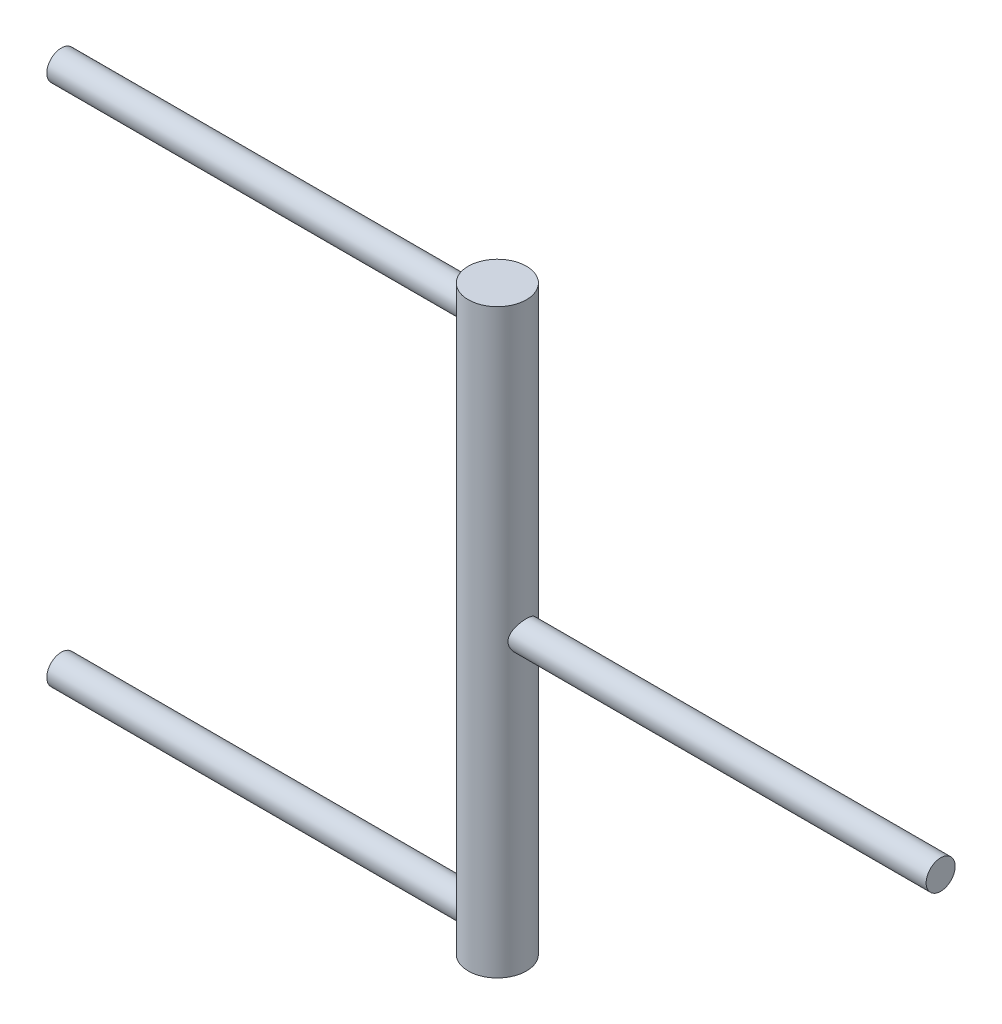
ISO-10303-21;
HEADER;
FILE_DESCRIPTION(('STEP AP214'),'2;1');
FILE_NAME('part.step','',(''),(''),'','','');
FILE_SCHEMA(('AUTOMOTIVE_DESIGN { 1 0 10303 214 1 1 1 1 }'));
ENDSEC;
DATA;
#1=APPLICATION_CONTEXT('core data for automotive mechanical design processes');
#2=APPLICATION_PROTOCOL_DEFINITION('international standard','automotive_design',2000,#1);
#3=PRODUCT_CONTEXT('',#1,'mechanical');
#4=PRODUCT('Part','Part','',(#3));
#5=PRODUCT_RELATED_PRODUCT_CATEGORY('part','',(#4));
#6=PRODUCT_DEFINITION_FORMATION('','',#4);
#7=PRODUCT_DEFINITION_CONTEXT('part definition',#1,'design');
#8=PRODUCT_DEFINITION('design','',#6,#7);
#9=PRODUCT_DEFINITION_SHAPE('','',#8);
#10=(LENGTH_UNIT() NAMED_UNIT(*) SI_UNIT(.MILLI.,.METRE.));
#11=(NAMED_UNIT(*) PLANE_ANGLE_UNIT() SI_UNIT($,.RADIAN.));
#12=(NAMED_UNIT(*) SI_UNIT($,.STERADIAN.) SOLID_ANGLE_UNIT());
#13=UNCERTAINTY_MEASURE_WITH_UNIT(LENGTH_MEASURE(1.E-05),#10,'distance_accuracy_value','');
#14=(GEOMETRIC_REPRESENTATION_CONTEXT(3) GLOBAL_UNCERTAINTY_ASSIGNED_CONTEXT((#13)) GLOBAL_UNIT_ASSIGNED_CONTEXT((#10,
#11,#12)) REPRESENTATION_CONTEXT('',''));
#15=CARTESIAN_POINT('',(0.,0.,0.));
#16=DIRECTION('',(0.,0.,1.));
#17=DIRECTION('',(1.,0.,0.));
#18=AXIS2_PLACEMENT_3D('',#15,#16,#17);
#19=CARTESIAN_POINT('',(-5.,-200.,0.));
#20=DIRECTION('',(0.,1.,0.));
#21=DIRECTION('',(0.,0.,1.));
#22=AXIS2_PLACEMENT_3D('',#19,#20,#21);
#23=CYLINDRICAL_SURFACE('',#22,20.);
#24=CARTESIAN_POINT('',(12.3205080756888,0.,10.));
#25=CARTESIAN_POINT('',(12.3205095702683,-0.260663040601147,9.99999887830497));
#26=CARTESIAN_POINT('',(12.3264124109147,-0.521348776578107,9.98979463038363));
#27=CARTESIAN_POINT('',(12.3498046872689,-1.04071147710562,9.94911125215874));
#28=CARTESIAN_POINT('',(12.3672995171185,-1.29938744972322,9.91862268285217));
#29=CARTESIAN_POINT('',(12.4132568469047,-1.81302338149322,9.83771551508561));
#30=CARTESIAN_POINT('',(12.4417365535713,-2.06797685618992,9.78726564599457));
#31=CARTESIAN_POINT('',(12.5086546907093,-2.57204988197364,9.66704369384918));
#32=CARTESIAN_POINT('',(12.5470974356035,-2.82116685451703,9.59726323891774));
#33=CARTESIAN_POINT('',(12.6323996319525,-3.31047368088695,9.43962165537102));
#34=CARTESIAN_POINT('',(12.6792090659448,-3.55070686856271,9.3518675445998));
#35=CARTESIAN_POINT('',(12.779982741108,-4.0225542268414,9.15882440342408));
#36=CARTESIAN_POINT('',(12.8339495753282,-4.25416523458851,9.05352901444523));
#37=CARTESIAN_POINT('',(12.9475017275461,-4.70754539101546,8.82628481748803));
#38=CARTESIAN_POINT('',(13.007085719386,-4.92931684462849,8.70433993726486));
#39=CARTESIAN_POINT('',(13.1303531605008,-5.36215966733293,8.44458163828187));
#40=CARTESIAN_POINT('',(13.1940367447196,-5.57323068379507,8.30676769705149));
#41=CARTESIAN_POINT('',(13.329363902558,-6.00083753007805,8.00400718237261));
#42=CARTESIAN_POINT('',(13.4012302839619,-6.21638249296305,7.83775940314261));
#43=CARTESIAN_POINT('',(13.5460965168945,-6.63293491021443,7.48852658775189));
#44=CARTESIAN_POINT('',(13.6190960729559,-6.83394607931892,7.30554585569179));
#45=CARTESIAN_POINT('',(13.7644955635795,-7.22069456367392,6.92354675196283));
#46=CARTESIAN_POINT('',(13.836894960655,-7.40641929054918,6.72451542443151));
#47=CARTESIAN_POINT('',(13.9792540720478,-7.76134678312636,6.31154503656169));
#48=CARTESIAN_POINT('',(14.0492146445795,-7.93055539930444,6.09761130143478));
#49=CARTESIAN_POINT('',(14.1896470662367,-8.26236413190357,5.64077435798557));
#50=CARTESIAN_POINT('',(14.2598322512756,-8.42373925262749,5.39689043752675));
#51=CARTESIAN_POINT('',(14.3935808273359,-8.72520656413285,4.89454568059951));
#52=CARTESIAN_POINT('',(14.4571438380477,-8.86529753278259,4.63608400824709));
#53=CARTESIAN_POINT('',(14.5757886087363,-9.12274892519535,4.10635184715094));
#54=CARTESIAN_POINT('',(14.6308744780683,-9.24012036957099,3.83508764838736));
#55=CARTESIAN_POINT('',(14.7309453282108,-9.45086297694423,3.28159286613366));
#56=CARTESIAN_POINT('',(14.775931381843,-9.54423668917914,2.99936345112905));
#57=CARTESIAN_POINT('',(14.8516061014691,-9.70002877590641,2.44661617022939));
#58=CARTESIAN_POINT('',(14.8830841882928,-9.76417670124883,2.17669338788491));
#59=CARTESIAN_POINT('',(14.9352303438994,-9.86993066791786,1.6314331616739));
#60=CARTESIAN_POINT('',(14.9558988826763,-9.91153768931533,1.35609595376428));
#61=CARTESIAN_POINT('',(14.9858180043386,-9.97163981941612,0.802434144223487));
#62=CARTESIAN_POINT('',(14.9950744057828,-9.9901467059464,0.524111138001231));
#63=CARTESIAN_POINT('',(15.001913600906,-10.003828626805,-0.0332441550447312));
#64=CARTESIAN_POINT('',(14.9994971087928,-9.99900508860886,-0.312276397429636));
#65=CARTESIAN_POINT('',(14.9837839047877,-9.96753604310577,-0.844365378154719));
#66=CARTESIAN_POINT('',(14.9714530082902,-9.94282745317377,-1.09756809880906));
#67=CARTESIAN_POINT('',(14.9374335863625,-9.87431737711415,-1.60072224441901));
#68=CARTESIAN_POINT('',(14.9157457197429,-9.83051723519245,-1.85067389700142));
#69=CARTESIAN_POINT('',(14.8635314520899,-9.72430038858304,-2.34564683757824));
#70=CARTESIAN_POINT('',(14.8330047631323,-9.66188307744028,-2.59066796468298));
#71=CARTESIAN_POINT('',(14.7638249456672,-9.51906901017155,-3.0742307116896));
#72=CARTESIAN_POINT('',(14.7251715252824,-9.43867160827142,-3.3127720985195));
#73=CARTESIAN_POINT('',(14.6400278970987,-9.2594279438338,-3.78519130198348));
#74=CARTESIAN_POINT('',(14.5934383954187,-9.16034597564547,-4.01896179863547));
#75=CARTESIAN_POINT('',(14.4938328204623,-8.94530980039125,-4.47722728595916));
#76=CARTESIAN_POINT('',(14.4408144703024,-8.82934961269359,-4.70171895241328));
#77=CARTESIAN_POINT('',(14.2738101334568,-8.45748528599377,-5.35951935176704));
#78=CARTESIAN_POINT('',(14.1518214470897,-8.17748838904003,-5.77743819792881));
#79=CARTESIAN_POINT('',(13.8844067887046,-7.53095999286111,-6.6018551358486));
#80=CARTESIAN_POINT('',(13.7378553723017,-7.15875049535114,-7.00353936956525));
#81=CARTESIAN_POINT('',(13.5185765182046,-6.55536158281013,-7.5565805421889));
#82=CARTESIAN_POINT('',(13.4455210194507,-6.34654803479791,-7.73279224461712));
#83=CARTESIAN_POINT('',(13.301419633557,-5.91467732627563,-8.06791510126962));
#84=CARTESIAN_POINT('',(13.2303740512964,-5.69161802140122,-8.22682364112475));
#85=CARTESIAN_POINT('',(13.0878347411401,-5.21766628308233,-8.53586780278159));
#86=CARTESIAN_POINT('',(13.0166021936665,-4.96590608929757,-8.68479491188952));
#87=CARTESIAN_POINT('',(12.8810231107822,-4.44894932780092,-8.96061518558477));
#88=CARTESIAN_POINT('',(12.8166734823335,-4.18375887497844,-9.08751826340232));
#89=CARTESIAN_POINT('',(12.6972138879565,-3.64159710083997,-9.31801905264336));
#90=CARTESIAN_POINT('',(12.6420984647868,-3.36463285982308,-9.42163054141924));
#91=CARTESIAN_POINT('',(12.5432965504952,-2.80075621026718,-9.6043511053739));
#92=CARTESIAN_POINT('',(12.4996085011007,-2.51384516415508,-9.68346352159404));
#93=CARTESIAN_POINT('',(12.4285246280669,-1.95549526733229,-9.81078056042748));
#94=CARTESIAN_POINT('',(12.400112529026,-1.68463061419365,-9.86093677879992));
#95=CARTESIAN_POINT('',(12.3557653968311,-1.13867425571044,-9.93878416908062));
#96=CARTESIAN_POINT('',(12.3398296585902,-0.863582790135209,-9.96647661050595));
#97=CARTESIAN_POINT('',(12.3211203070709,-0.311769305805099,-9.99895720583311));
#98=CARTESIAN_POINT('',(12.3183387420978,-0.0350483733949728,-10.0037591970207));
#99=CARTESIAN_POINT('',(12.3260388316313,0.517642847625729,-9.99041751959192));
#100=CARTESIAN_POINT('',(12.3365195908785,0.793613185644207,-9.97227539979392));
#101=CARTESIAN_POINT('',(12.3684286609902,1.31216990198845,-9.91658048540566));
#102=CARTESIAN_POINT('',(12.3885290217086,1.55509564865941,-9.88137691490021));
#103=CARTESIAN_POINT('',(12.4382137869217,2.03684180135887,-9.79342893834458));
#104=CARTESIAN_POINT('',(12.467801331278,2.27566082062271,-9.74067872487188));
#105=CARTESIAN_POINT('',(12.5355331166034,2.74762719334964,-9.61821012578334));
#106=CARTESIAN_POINT('',(12.5736762155234,2.98077529920184,-9.54849400477786));
#107=CARTESIAN_POINT('',(12.6574071681516,3.4402243463203,-9.39275103363472));
#108=CARTESIAN_POINT('',(12.7029979734995,3.66652253053967,-9.30671771455721));
#109=CARTESIAN_POINT('',(12.8535843814249,4.35383808761784,-9.01657018480756));
#110=CARTESIAN_POINT('',(12.9691397733146,4.80167280554,-8.78600743614721));
#111=CARTESIAN_POINT('',(13.2156365133527,5.65481013879034,-8.26280380655757));
#112=CARTESIAN_POINT('',(13.3465857498225,6.06009074482001,-7.97013103597558));
#113=CARTESIAN_POINT('',(13.5540860890308,6.65541000031589,-7.46888401537909));
#114=CARTESIAN_POINT('',(13.6294365394137,6.86219340962804,-7.27935116097346));
#115=CARTESIAN_POINT('',(13.7793184193833,7.25924233756314,-6.88345408602483));
#116=CARTESIAN_POINT('',(13.8538500850067,7.4495127317777,-6.67709486873341));
#117=CARTESIAN_POINT('',(14.0002370989649,7.81259448022043,-6.24838707618251));
#118=CARTESIAN_POINT('',(14.0720904041602,7.98539267147156,-6.02602665885359));
#119=CARTESIAN_POINT('',(14.2111944255316,8.312150006922,-5.56664786728031));
#120=CARTESIAN_POINT('',(14.2784470951099,8.46611716881704,-5.32963579644157));
#121=CARTESIAN_POINT('',(14.4083463032874,8.75793565450039,-4.83560208582895));
#122=CARTESIAN_POINT('',(14.4708214998861,8.8952456931089,-4.57821478300822));
#123=CARTESIAN_POINT('',(14.5873354303861,9.14747092025089,-4.05082787591116));
#124=CARTESIAN_POINT('',(14.6413738815295,9.26238535822693,-3.78082784931273));
#125=CARTESIAN_POINT('',(14.7393769209225,9.46843239656662,-3.23033940661204));
#126=CARTESIAN_POINT('',(14.7833487026856,9.55958198549655,-2.94985864767703));
#127=CARTESIAN_POINT('',(14.8599022734451,9.71701906223855,-2.38049331567771));
#128=CARTESIAN_POINT('',(14.8924854130529,9.78330949823626,-2.09160974353147));
#129=CARTESIAN_POINT('',(14.9427983622959,9.88518953192547,-1.53480500342458));
#130=CARTESIAN_POINT('',(14.9616170482062,9.92303866767678,-1.26739371229205));
#131=CARTESIAN_POINT('',(14.9884894545243,9.97698669860713,-0.729851996988025));
#132=CARTESIAN_POINT('',(14.9965438581379,9.99308697418068,-0.459721746484661));
#133=CARTESIAN_POINT('',(15.0016629969108,10.003326494719,0.080975941930303));
#134=CARTESIAN_POINT('',(14.998731006214,9.9974722825172,0.351543225574787));
#135=CARTESIAN_POINT('',(14.9819662987136,9.96389432871813,0.890971567979913));
#136=CARTESIAN_POINT('',(14.9681338819984,9.93617118917184,1.15983267350619));
#137=CARTESIAN_POINT('',(14.9312153598393,9.86175992153986,1.67605139696945));
#138=CARTESIAN_POINT('',(14.9088004475429,9.81644464428,1.9236568390133));
#139=CARTESIAN_POINT('',(14.8553300434365,9.70754249215298,2.41384547185346));
#140=CARTESIAN_POINT('',(14.8242750394308,9.64395664880287,2.65642894535069));
#141=CARTESIAN_POINT('',(14.7542370428942,9.49915225873876,3.13506320784849));
#142=CARTESIAN_POINT('',(14.7152547758225,9.41793532547844,3.3711145923855));
#143=CARTESIAN_POINT('',(14.6302044089834,9.23856912904384,3.83546861689578));
#144=CARTESIAN_POINT('',(14.5841335855708,9.14041335566642,4.06376823706493));
#145=CARTESIAN_POINT('',(14.483810895842,8.92348162857292,4.52085803757348));
#146=CARTESIAN_POINT('',(14.4292950766497,8.80400812469997,4.74925902682011));
#147=CARTESIAN_POINT('',(14.3148302804231,8.54843405741246,5.19522438508584));
#148=CARTESIAN_POINT('',(14.2548794530109,8.41232782576697,5.41278502408942));
#149=CARTESIAN_POINT('',(14.1308402275846,8.12440327033305,5.83606045705828));
#150=CARTESIAN_POINT('',(14.0667510038749,7.97258180736485,6.04177287147123));
#151=CARTESIAN_POINT('',(13.9358010862794,7.65412499105662,6.44045588132558));
#152=CARTESIAN_POINT('',(13.8689402387161,7.48748881570029,6.63342576869236));
#153=CARTESIAN_POINT('',(13.7271146644604,7.12290472592842,7.02443076725262));
#154=CARTESIAN_POINT('',(13.6520069761602,6.92349155423945,7.22105023736916));
#155=CARTESIAN_POINT('',(13.5021161963615,6.50888979543717,7.5968825226208));
#156=CARTESIAN_POINT('',(13.4273330205942,6.29370560006311,7.77610015155213));
#157=CARTESIAN_POINT('',(13.2800108882226,5.84833281474919,8.1163793026012));
#158=CARTESIAN_POINT('',(13.2074742403954,5.61812949786453,8.27742256848714));
#159=CARTESIAN_POINT('',(13.0668000353187,5.14397876327106,8.58012843326388));
#160=CARTESIAN_POINT('',(12.9986630979644,4.90002941784971,8.72178830427269));
#161=CARTESIAN_POINT('',(12.8668466988412,4.39162550797976,8.98880823408349));
#162=CARTESIAN_POINT('',(12.8033795439981,4.12676463867865,9.11350193984134));
#163=CARTESIAN_POINT('',(12.6857538350981,3.58547161497902,9.33972032642159));
#164=CARTESIAN_POINT('',(12.6315904873914,3.30904551125245,9.44125694748286));
#165=CARTESIAN_POINT('',(12.5348420080576,2.74718888599988,9.61975104079584));
#166=CARTESIAN_POINT('',(12.4922271352712,2.46178364824421,9.69677174083926));
#167=CARTESIAN_POINT('',(12.420295302782,1.88381447750883,9.82541504864774));
#168=CARTESIAN_POINT('',(12.3909690467734,1.59125570040183,9.87705541385781));
#169=CARTESIAN_POINT('',(12.3529508814928,1.08200444761762,9.94364603197745));
#170=CARTESIAN_POINT('',(12.340814385915,0.866351679703954,9.96475859003794));
#171=CARTESIAN_POINT('',(12.3245920918704,0.433804567870859,9.99293651062053));
#172=CARTESIAN_POINT('',(12.3205068319779,0.216910141865975,10.0000009334159));
#173=CARTESIAN_POINT('',(12.3205080756888,0.,10.));
#174=B_SPLINE_CURVE_WITH_KNOTS('',3,(#24,#25,#26,#27,#28,#29,#30,#31,#32,#33,#34,#35,#36,#37,
#38,#39,#40,#41,#42,#43,#44,#45,#46,#47,#48,#49,#50,#51,#52,#53,#54,#55,#56,#57,#58,#59,#60,#61,
#62,#63,#64,#65,#66,#67,#68,#69,#70,#71,#72,#73,#74,#75,#76,#77,#78,#79,#80,#81,#82,#83,#84,#85,
#86,#87,#88,#89,#90,#91,#92,#93,#94,#95,#96,#97,#98,#99,#100,#101,#102,#103,#104,#105,#106,#107,
#108,#109,#110,#111,#112,#113,#114,#115,#116,#117,#118,#119,#120,#121,#122,#123,#124,#125,#126,
#127,#128,#129,#130,#131,#132,#133,#134,#135,#136,#137,#138,#139,#140,#141,#142,#143,#144,#145,
#146,#147,#148,#149,#150,#151,#152,#153,#154,#155,#156,#157,#158,#159,#160,#161,#162,#163,#164,
#165,#166,#167,#168,#169,#170,#171,#172,#173),.UNSPECIFIED.,.T.,.F.,(4,2,2,2,2,2,2,2,2,2,2,2,2,
2,2,2,2,2,2,2,2,2,2,2,2,2,2,2,2,2,2,2,2,2,2,2,2,2,2,2,2,2,2,2,2,2,2,2,2,2,2,2,2,2,2,2,2,2,2,2,2,
2,2,2,2,2,2,2,2,2,2,2,2,2,4),(0.,0.781764769112957,1.56389357534752,2.34725251774208,
3.13095125664016,3.91011273597292,4.68955727220399,5.46881824759952,6.24810488660504,
7.09181817840652,7.93531505492037,8.77949974187696,9.62338430104276,10.5244589431129,
11.4255853051681,12.3262734543218,13.2268658853578,14.0633930705159,14.8998838808356,
15.735948023788,16.571961012676,17.3351709001918,18.0983270599865,18.8615080823398,
19.6247165195584,20.3982891735806,21.1721366058307,22.7189130677432,24.411902278383,
25.2596540794492,26.1075337917995,27.0095657903684,27.9111907165882,28.8122809054192,
29.7132481546281,30.542861630924,31.3724282192078,32.2014932705296,33.0305023596626,
33.7685142503992,34.5067706447974,35.244928550686,35.9833797127091,37.5272041097115,
39.0718230911075,39.9423348698487,40.8125887427685,41.6834934262,42.5540260036818,
43.4478458060077,44.3416955583132,45.2349045692787,46.1280076160786,46.9391312005144,
47.7502033007272,48.5610337060351,49.371841789984,50.1291222204445,50.8863599048713,
51.6435283222654,52.4009883973669,53.1905472291719,53.980375887315,54.7703626224473,
55.5603932185549,56.4292490887194,57.297863922184,58.1673436596753,59.03694563602,
59.9343645678529,60.8313197217513,61.7259424792672,62.6199384164504,63.2704386348099,
63.9209823658392),.UNSPECIFIED.);
#175=CARTESIAN_POINT('',(12.3205080756888,0.,10.));
#176=VERTEX_POINT('',#175);
#177=EDGE_CURVE('E46',#176,#176,#174,.T.);
#178=ORIENTED_EDGE('',*,*,#177,.F.);
#179=EDGE_LOOP('',(#178));
#180=FACE_BOUND('',#179,.T.);
#181=CARTESIAN_POINT('',(-5.,-200.,0.));
#182=DIRECTION('',(0.,1.,0.));
#183=DIRECTION('',(0.,0.,1.));
#184=AXIS2_PLACEMENT_3D('',#181,#182,#183);
#185=CIRCLE('',#184,20.);
#186=CARTESIAN_POINT('',(-5.,-200.,20.));
#187=VERTEX_POINT('',#186);
#188=EDGE_CURVE('E75',#187,#187,#185,.T.);
#189=ORIENTED_EDGE('',*,*,#188,.T.);
#190=EDGE_LOOP('',(#189));
#191=FACE_BOUND('',#190,.T.);
#192=CARTESIAN_POINT('',(-5.,200.,0.));
#193=DIRECTION('',(0.,1.,0.));
#194=DIRECTION('',(0.,0.,1.));
#195=AXIS2_PLACEMENT_3D('',#192,#193,#194);
#196=CIRCLE('',#195,20.);
#197=CARTESIAN_POINT('',(-5.,200.,20.));
#198=VERTEX_POINT('',#197);
#199=EDGE_CURVE('E77',#198,#198,#196,.T.);
#200=ORIENTED_EDGE('',*,*,#199,.F.);
#201=EDGE_LOOP('',(#200));
#202=FACE_BOUND('',#201,.T.);
#203=CARTESIAN_POINT('',(-22.3205080756888,180.,-10.));
#204=CARTESIAN_POINT('',(-22.3205095702683,179.739336959399,-9.99999887830498));
#205=CARTESIAN_POINT('',(-22.3264124109147,179.478651223422,-9.98979463038363));
#206=CARTESIAN_POINT('',(-22.3498046872689,178.959288522894,-9.94911125215875));
#207=CARTESIAN_POINT('',(-22.3672995171185,178.700612550277,-9.91862268285218));
#208=CARTESIAN_POINT('',(-22.4132568469047,178.186976618507,-9.83771551508562));
#209=CARTESIAN_POINT('',(-22.4417365535713,177.93202314381,-9.78726564599457));
#210=CARTESIAN_POINT('',(-22.5086546907093,177.427950118026,-9.66704369384919));
#211=CARTESIAN_POINT('',(-22.5470974356035,177.178833145483,-9.59726323891774));
#212=CARTESIAN_POINT('',(-22.6323996319525,176.689526319113,-9.43962165537103));
#213=CARTESIAN_POINT('',(-22.6792090659448,176.449293131437,-9.35186754459981));
#214=CARTESIAN_POINT('',(-22.779982741108,175.977445773159,-9.1588244034241));
#215=CARTESIAN_POINT('',(-22.8339495753281,175.745834765412,-9.05352901444524));
#216=CARTESIAN_POINT('',(-22.9475017275461,175.292454608985,-8.82628481748804));
#217=CARTESIAN_POINT('',(-23.007085719386,175.070683155372,-8.70433993726488));
#218=CARTESIAN_POINT('',(-23.1303531605008,174.637840332667,-8.4445816382819));
#219=CARTESIAN_POINT('',(-23.1940367447196,174.426769316205,-8.30676769705151));
#220=CARTESIAN_POINT('',(-23.329363902558,173.999162469922,-8.00400718237262));
#221=CARTESIAN_POINT('',(-23.4012302839619,173.783617507037,-7.83775940314262));
#222=CARTESIAN_POINT('',(-23.5460965168945,173.367065089786,-7.48852658775191));
#223=CARTESIAN_POINT('',(-23.6190960729559,173.166053920681,-7.3055458556918));
#224=CARTESIAN_POINT('',(-23.7644955635795,172.779305436326,-6.92354675196284));
#225=CARTESIAN_POINT('',(-23.836894960655,172.593580709451,-6.72451542443151));
#226=CARTESIAN_POINT('',(-23.9792540720478,172.238653216874,-6.31154503656169));
#227=CARTESIAN_POINT('',(-24.0492146445795,172.069444600696,-6.09761130143478));
#228=CARTESIAN_POINT('',(-24.1896470662367,171.737635868096,-5.64077435798556));
#229=CARTESIAN_POINT('',(-24.2598322512756,171.576260747373,-5.39689043752674));
#230=CARTESIAN_POINT('',(-24.3935808273359,171.274793435867,-4.8945456805995));
#231=CARTESIAN_POINT('',(-24.4571438380477,171.134702467217,-4.63608400824708));
#232=CARTESIAN_POINT('',(-24.5757886087363,170.877251074805,-4.10635184715093));
#233=CARTESIAN_POINT('',(-24.6308744780683,170.759879630429,-3.83508764838735));
#234=CARTESIAN_POINT('',(-24.7309453282108,170.549137023056,-3.28159286613364));
#235=CARTESIAN_POINT('',(-24.775931381843,170.455763310821,-2.99936345112903));
#236=CARTESIAN_POINT('',(-24.8516061014691,170.299971224094,-2.44661617022938));
#237=CARTESIAN_POINT('',(-24.8830841882928,170.235823298751,-2.1766933878849));
#238=CARTESIAN_POINT('',(-24.9352303438994,170.130069332082,-1.63143316167389));
#239=CARTESIAN_POINT('',(-24.9558988826763,170.088462310685,-1.35609595376427));
#240=CARTESIAN_POINT('',(-24.9858180043386,170.028360180584,-0.802434144223473));
#241=CARTESIAN_POINT('',(-24.9950744057828,170.009853294054,-0.524111138001218));
#242=CARTESIAN_POINT('',(-25.001913600906,169.996171373195,0.0332441550447443));
#243=CARTESIAN_POINT('',(-24.9994971087928,170.000994911391,0.312276397429648));
#244=CARTESIAN_POINT('',(-24.9837839047877,170.032463956894,0.844365378154735));
#245=CARTESIAN_POINT('',(-24.9714530082902,170.057172546826,1.09756809880908));
#246=CARTESIAN_POINT('',(-24.9374335863625,170.125682622886,1.60072224441903));
#247=CARTESIAN_POINT('',(-24.9157457197429,170.169482764808,1.85067389700144));
#248=CARTESIAN_POINT('',(-24.8635314520899,170.275699611417,2.34564683757826));
#249=CARTESIAN_POINT('',(-24.8330047631323,170.33811692256,2.590667964683));
#250=CARTESIAN_POINT('',(-24.7638249456672,170.480930989828,3.07423071168962));
#251=CARTESIAN_POINT('',(-24.7251715252824,170.561328391729,3.31277209851952));
#252=CARTESIAN_POINT('',(-24.6400278970987,170.740572056166,3.7851913019835));
#253=CARTESIAN_POINT('',(-24.5934383954188,170.839654024355,4.01896179863549));
#254=CARTESIAN_POINT('',(-24.4938328204623,171.054690199609,4.47722728595918));
#255=CARTESIAN_POINT('',(-24.4408144703024,171.170650387306,4.7017189524133));
#256=CARTESIAN_POINT('',(-24.2738101334568,171.542514714006,5.35951935176706));
#257=CARTESIAN_POINT('',(-24.1518214470896,171.82251161096,5.77743819792883));
#258=CARTESIAN_POINT('',(-23.8844067887046,172.469040007139,6.60185513584861));
#259=CARTESIAN_POINT('',(-23.7378553723017,172.841249504649,7.00353936956527));
#260=CARTESIAN_POINT('',(-23.5185765182046,173.44463841719,7.55658054218892));
#261=CARTESIAN_POINT('',(-23.4455210194507,173.653451965202,7.73279224461714));
#262=CARTESIAN_POINT('',(-23.301419633557,174.085322673724,8.06791510126963));
#263=CARTESIAN_POINT('',(-23.2303740512964,174.308381978599,8.22682364112475));
#264=CARTESIAN_POINT('',(-23.0878347411401,174.782333716918,8.53586780278159));
#265=CARTESIAN_POINT('',(-23.0166021936665,175.034093910702,8.68479491188952));
#266=CARTESIAN_POINT('',(-22.8810231107822,175.551050672199,8.96061518558477));
#267=CARTESIAN_POINT('',(-22.8166734823335,175.816241125022,9.08751826340233));
#268=CARTESIAN_POINT('',(-22.6972138879565,176.35840289916,9.31801905264337));
#269=CARTESIAN_POINT('',(-22.6420984647868,176.635367140177,9.42163054141925));
#270=CARTESIAN_POINT('',(-22.5432965504952,177.199243789733,9.60435110537392));
#271=CARTESIAN_POINT('',(-22.4996085011007,177.486154835845,9.68346352159405));
#272=CARTESIAN_POINT('',(-22.4285246280669,178.044504732668,9.81078056042749));
#273=CARTESIAN_POINT('',(-22.400112529026,178.315369385806,9.86093677879993));
#274=CARTESIAN_POINT('',(-22.3557653968311,178.86132574429,9.93878416908064));
#275=CARTESIAN_POINT('',(-22.3398296585902,179.136417209865,9.96647661050596));
#276=CARTESIAN_POINT('',(-22.3211203070709,179.688230694195,9.99895720583312));
#277=CARTESIAN_POINT('',(-22.3183387420978,179.964951626605,10.0037591970207));
#278=CARTESIAN_POINT('',(-22.3260388316313,180.517642847626,9.99041751959193));
#279=CARTESIAN_POINT('',(-22.3365195908785,180.793613185644,9.97227539979392));
#280=CARTESIAN_POINT('',(-22.3684286609902,181.312169901988,9.91658048540567));
#281=CARTESIAN_POINT('',(-22.3885290217086,181.555095648659,9.88137691490022));
#282=CARTESIAN_POINT('',(-22.4382137869217,182.036841801359,9.7934289383446));
#283=CARTESIAN_POINT('',(-22.467801331278,182.275660820623,9.74067872487189));
#284=CARTESIAN_POINT('',(-22.5355331166034,182.74762719335,9.61821012578335));
#285=CARTESIAN_POINT('',(-22.5736762155234,182.980775299202,9.54849400477787));
#286=CARTESIAN_POINT('',(-22.6574071681516,183.44022434632,9.39275103363473));
#287=CARTESIAN_POINT('',(-22.7029979734995,183.66652253054,9.30671771455722));
#288=CARTESIAN_POINT('',(-22.8535843814249,184.353838087618,9.01657018480756));
#289=CARTESIAN_POINT('',(-22.9691397733146,184.80167280554,8.78600743614722));
#290=CARTESIAN_POINT('',(-23.2156365133527,185.65481013879,8.26280380655758));
#291=CARTESIAN_POINT('',(-23.3465857498225,186.06009074482,7.97013103597559));
#292=CARTESIAN_POINT('',(-23.5540860890308,186.655410000316,7.46888401537909));
#293=CARTESIAN_POINT('',(-23.6294365394137,186.862193409628,7.27935116097345));
#294=CARTESIAN_POINT('',(-23.7793184193833,187.259242337563,6.88345408602482));
#295=CARTESIAN_POINT('',(-23.8538500850067,187.449512731778,6.6770948687334));
#296=CARTESIAN_POINT('',(-24.0002370989649,187.81259448022,6.2483870761825));
#297=CARTESIAN_POINT('',(-24.0720904041602,187.985392671472,6.02602665885358));
#298=CARTESIAN_POINT('',(-24.2111944255316,188.312150006922,5.56664786728031));
#299=CARTESIAN_POINT('',(-24.2784470951099,188.466117168817,5.32963579644157));
#300=CARTESIAN_POINT('',(-24.4083463032874,188.7579356545,4.83560208582895));
#301=CARTESIAN_POINT('',(-24.4708214998861,188.895245693109,4.57821478300821));
#302=CARTESIAN_POINT('',(-24.5873354303861,189.147470920251,4.05082787591116));
#303=CARTESIAN_POINT('',(-24.6413738815295,189.262385358227,3.78082784931272));
#304=CARTESIAN_POINT('',(-24.7393769209225,189.468432396567,3.23033940661202));
#305=CARTESIAN_POINT('',(-24.7833487026856,189.559581985497,2.94985864767701));
#306=CARTESIAN_POINT('',(-24.8599022734451,189.717019062239,2.3804933156777));
#307=CARTESIAN_POINT('',(-24.8924854130529,189.783309498236,2.09160974353146));
#308=CARTESIAN_POINT('',(-24.9427983622959,189.885189531925,1.53480500342457));
#309=CARTESIAN_POINT('',(-24.9616170482062,189.923038667677,1.26739371229204));
#310=CARTESIAN_POINT('',(-24.9884894545243,189.976986698607,0.729851996988014));
#311=CARTESIAN_POINT('',(-24.9965438581379,189.993086974181,0.459721746484649));
#312=CARTESIAN_POINT('',(-25.0016629969108,190.003326494719,-0.0809759419303151));
#313=CARTESIAN_POINT('',(-24.998731006214,189.997472282517,-0.351543225574799));
#314=CARTESIAN_POINT('',(-24.9819662987136,189.963894328718,-0.890971567979924));
#315=CARTESIAN_POINT('',(-24.9681338819984,189.936171189172,-1.1598326735062));
#316=CARTESIAN_POINT('',(-24.9312153598393,189.86175992154,-1.67605139696946));
#317=CARTESIAN_POINT('',(-24.9088004475429,189.81644464428,-1.92365683901331));
#318=CARTESIAN_POINT('',(-24.8553300434365,189.707542492153,-2.41384547185347));
#319=CARTESIAN_POINT('',(-24.8242750394308,189.643956648803,-2.65642894535071));
#320=CARTESIAN_POINT('',(-24.7542370428942,189.499152258739,-3.1350632078485));
#321=CARTESIAN_POINT('',(-24.7152547758225,189.417935325478,-3.37111459238551));
#322=CARTESIAN_POINT('',(-24.6302044089834,189.238569129044,-3.83546861689579));
#323=CARTESIAN_POINT('',(-24.5841335855708,189.140413355666,-4.06376823706494));
#324=CARTESIAN_POINT('',(-24.483810895842,188.923481628573,-4.5208580375735));
#325=CARTESIAN_POINT('',(-24.4292950766497,188.8040081247,-4.74925902682013));
#326=CARTESIAN_POINT('',(-24.3148302804231,188.548434057412,-5.19522438508586));
#327=CARTESIAN_POINT('',(-24.2548794530109,188.412327825767,-5.41278502408943));
#328=CARTESIAN_POINT('',(-24.1308402275846,188.124403270333,-5.8360604570583));
#329=CARTESIAN_POINT('',(-24.0667510038749,187.972581807365,-6.04177287147125));
#330=CARTESIAN_POINT('',(-23.9358010862794,187.654124991057,-6.4404558813256));
#331=CARTESIAN_POINT('',(-23.8689402387161,187.4874888157,-6.63342576869238));
#332=CARTESIAN_POINT('',(-23.7271146644604,187.122904725928,-7.02443076725264));
#333=CARTESIAN_POINT('',(-23.6520069761602,186.923491554239,-7.22105023736919));
#334=CARTESIAN_POINT('',(-23.5021161963615,186.508889795437,-7.59688252262082));
#335=CARTESIAN_POINT('',(-23.4273330205942,186.293705600063,-7.77610015155214));
#336=CARTESIAN_POINT('',(-23.2800108882226,185.848332814749,-8.1163793026012));
#337=CARTESIAN_POINT('',(-23.2074742403954,185.618129497865,-8.27742256848715));
#338=CARTESIAN_POINT('',(-23.0668000353187,185.143978763271,-8.58012843326389));
#339=CARTESIAN_POINT('',(-22.9986630979644,184.90002941785,-8.7217883042727));
#340=CARTESIAN_POINT('',(-22.8668466988412,184.39162550798,-8.98880823408351));
#341=CARTESIAN_POINT('',(-22.8033795439981,184.126764638679,-9.11350193984136));
#342=CARTESIAN_POINT('',(-22.6857538350981,183.585471614979,-9.33972032642161));
#343=CARTESIAN_POINT('',(-22.6315904873913,183.309045511252,-9.44125694748288));
#344=CARTESIAN_POINT('',(-22.5348420080576,182.747188886,-9.61975104079585));
#345=CARTESIAN_POINT('',(-22.4922271352712,182.461783648244,-9.69677174083927));
#346=CARTESIAN_POINT('',(-22.4202953027819,181.883814477509,-9.82541504864776));
#347=CARTESIAN_POINT('',(-22.3909690467734,181.591255700402,-9.87705541385783));
#348=CARTESIAN_POINT('',(-22.3529508814928,181.082004447618,-9.94364603197747));
#349=CARTESIAN_POINT('',(-22.340814385915,180.866351679704,-9.96475859003796));
#350=CARTESIAN_POINT('',(-22.3245920918704,180.433804567871,-9.99293651062054));
#351=CARTESIAN_POINT('',(-22.3205068319779,180.216910141866,-10.0000009334159));
#352=CARTESIAN_POINT('',(-22.3205080756888,180.,-10.));
#353=B_SPLINE_CURVE_WITH_KNOTS('',3,(#203,#204,#205,#206,#207,#208,#209,#210,#211,#212,#213,
#214,#215,#216,#217,#218,#219,#220,#221,#222,#223,#224,#225,#226,#227,#228,#229,#230,#231,#232,
#233,#234,#235,#236,#237,#238,#239,#240,#241,#242,#243,#244,#245,#246,#247,#248,#249,#250,#251,
#252,#253,#254,#255,#256,#257,#258,#259,#260,#261,#262,#263,#264,#265,#266,#267,#268,#269,#270,
#271,#272,#273,#274,#275,#276,#277,#278,#279,#280,#281,#282,#283,#284,#285,#286,#287,#288,#289,
#290,#291,#292,#293,#294,#295,#296,#297,#298,#299,#300,#301,#302,#303,#304,#305,#306,#307,#308,
#309,#310,#311,#312,#313,#314,#315,#316,#317,#318,#319,#320,#321,#322,#323,#324,#325,#326,#327,
#328,#329,#330,#331,#332,#333,#334,#335,#336,#337,#338,#339,#340,#341,#342,#343,#344,#345,#346,
#347,#348,#349,#350,#351,#352),.UNSPECIFIED.,.T.,.F.,(4,2,2,2,2,2,2,2,2,2,2,2,2,2,2,2,2,2,2,2,2,
2,2,2,2,2,2,2,2,2,2,2,2,2,2,2,2,2,2,2,2,2,2,2,2,2,2,2,2,2,2,2,2,2,2,2,2,2,2,2,2,2,2,2,2,2,2,2,2,
2,2,2,2,2,4),(0.,0.781764769112956,1.56389357534751,2.34725251774209,3.13095125664017,
3.91011273597289,4.68955727220399,5.4688182475995,6.24810488660502,7.09181817840653,
7.93531505492038,8.77949974187698,9.62338430104279,10.5244589431129,11.4255853051682,
12.3262734543219,13.2268658853579,14.063393070516,14.8998838808356,15.7359480237881,
16.571961012676,17.3351709001918,18.0983270599865,18.8615080823399,19.6247165195585,
20.3982891735807,21.1721366058307,22.7189130677432,24.411902278383,25.2596540794493,
26.1075337917995,27.0095657903684,27.9111907165882,28.8122809054192,29.7132481546281,
30.5428616309241,31.3724282192078,32.2014932705296,33.0305023596627,33.7685142503992,
34.5067706447975,35.2449285506861,35.9833797127091,37.5272041097116,39.0718230911076,
39.9423348698488,40.8125887427686,41.6834934262001,42.5540260036819,43.4478458060078,
44.3416955583133,45.2349045692788,46.1280076160787,46.9391312005145,47.7502033007273,
48.5610337060351,49.3718417899841,50.1291222204446,50.8863599048714,51.6435283222655,
52.400988397367,53.190547229172,53.9803758873151,54.7703626224474,55.560393218555,
56.4292490887195,57.2978639221841,58.1673436596754,59.0369456360201,59.934364567853,
60.8313197217514,61.7259424792673,62.6199384164505,63.2704386348101,63.9209823658393),.UNSPECIFIED.);
#354=CARTESIAN_POINT('',(-22.3205080756888,180.,-10.));
#355=VERTEX_POINT('',#354);
#356=EDGE_CURVE('E10',#355,#355,#353,.T.);
#357=ORIENTED_EDGE('',*,*,#356,.F.);
#358=EDGE_LOOP('',(#357));
#359=FACE_BOUND('',#358,.T.);
#360=CARTESIAN_POINT('',(-22.3205080756888,-180.,-10.));
#361=CARTESIAN_POINT('',(-22.3205095702683,-179.739336959399,-9.99999887830498));
#362=CARTESIAN_POINT('',(-22.3264124109147,-179.478651223422,-9.98979463038363));
#363=CARTESIAN_POINT('',(-22.3498046872689,-178.959288522894,-9.94911125215875));
#364=CARTESIAN_POINT('',(-22.3672995171185,-178.700612550277,-9.91862268285218));
#365=CARTESIAN_POINT('',(-22.4132568469047,-178.186976618507,-9.83771551508562));
#366=CARTESIAN_POINT('',(-22.4417365535713,-177.93202314381,-9.78726564599457));
#367=CARTESIAN_POINT('',(-22.5086546907093,-177.427950118026,-9.66704369384919));
#368=CARTESIAN_POINT('',(-22.5470974356035,-177.178833145483,-9.59726323891774));
#369=CARTESIAN_POINT('',(-22.6323996319525,-176.689526319113,-9.43962165537103));
#370=CARTESIAN_POINT('',(-22.6792090659448,-176.449293131437,-9.35186754459981));
#371=CARTESIAN_POINT('',(-22.779982741108,-175.977445773159,-9.1588244034241));
#372=CARTESIAN_POINT('',(-22.8339495753281,-175.745834765412,-9.05352901444524));
#373=CARTESIAN_POINT('',(-22.9475017275461,-175.292454608985,-8.82628481748804));
#374=CARTESIAN_POINT('',(-23.007085719386,-175.070683155372,-8.70433993726488));
#375=CARTESIAN_POINT('',(-23.1303531605008,-174.637840332667,-8.4445816382819));
#376=CARTESIAN_POINT('',(-23.1940367447196,-174.426769316205,-8.30676769705151));
#377=CARTESIAN_POINT('',(-23.329363902558,-173.999162469922,-8.00400718237262));
#378=CARTESIAN_POINT('',(-23.4012302839619,-173.783617507037,-7.83775940314262));
#379=CARTESIAN_POINT('',(-23.5460965168945,-173.367065089786,-7.48852658775191));
#380=CARTESIAN_POINT('',(-23.6190960729559,-173.166053920681,-7.3055458556918));
#381=CARTESIAN_POINT('',(-23.7644955635795,-172.779305436326,-6.92354675196284));
#382=CARTESIAN_POINT('',(-23.836894960655,-172.593580709451,-6.72451542443151));
#383=CARTESIAN_POINT('',(-23.9792540720478,-172.238653216874,-6.31154503656169));
#384=CARTESIAN_POINT('',(-24.0492146445795,-172.069444600696,-6.09761130143478));
#385=CARTESIAN_POINT('',(-24.1896470662367,-171.737635868096,-5.64077435798556));
#386=CARTESIAN_POINT('',(-24.2598322512756,-171.576260747373,-5.39689043752674));
#387=CARTESIAN_POINT('',(-24.3935808273359,-171.274793435867,-4.8945456805995));
#388=CARTESIAN_POINT('',(-24.4571438380477,-171.134702467217,-4.63608400824708));
#389=CARTESIAN_POINT('',(-24.5757886087363,-170.877251074805,-4.10635184715093));
#390=CARTESIAN_POINT('',(-24.6308744780683,-170.759879630429,-3.83508764838735));
#391=CARTESIAN_POINT('',(-24.7309453282108,-170.549137023056,-3.28159286613364));
#392=CARTESIAN_POINT('',(-24.775931381843,-170.455763310821,-2.99936345112903));
#393=CARTESIAN_POINT('',(-24.8516061014691,-170.299971224094,-2.44661617022938));
#394=CARTESIAN_POINT('',(-24.8830841882928,-170.235823298751,-2.1766933878849));
#395=CARTESIAN_POINT('',(-24.9352303438994,-170.130069332082,-1.63143316167389));
#396=CARTESIAN_POINT('',(-24.9558988826763,-170.088462310685,-1.35609595376427));
#397=CARTESIAN_POINT('',(-24.9858180043386,-170.028360180584,-0.802434144223473));
#398=CARTESIAN_POINT('',(-24.9950744057828,-170.009853294054,-0.524111138001218));
#399=CARTESIAN_POINT('',(-25.001913600906,-169.996171373195,0.0332441550447443));
#400=CARTESIAN_POINT('',(-24.9994971087928,-170.000994911391,0.312276397429648));
#401=CARTESIAN_POINT('',(-24.9837839047877,-170.032463956894,0.844365378154735));
#402=CARTESIAN_POINT('',(-24.9714530082902,-170.057172546826,1.09756809880908));
#403=CARTESIAN_POINT('',(-24.9374335863625,-170.125682622886,1.60072224441903));
#404=CARTESIAN_POINT('',(-24.9157457197429,-170.169482764808,1.85067389700144));
#405=CARTESIAN_POINT('',(-24.8635314520899,-170.275699611417,2.34564683757826));
#406=CARTESIAN_POINT('',(-24.8330047631323,-170.33811692256,2.590667964683));
#407=CARTESIAN_POINT('',(-24.7638249456672,-170.480930989828,3.07423071168962));
#408=CARTESIAN_POINT('',(-24.7251715252824,-170.561328391729,3.31277209851952));
#409=CARTESIAN_POINT('',(-24.6400278970987,-170.740572056166,3.7851913019835));
#410=CARTESIAN_POINT('',(-24.5934383954188,-170.839654024355,4.01896179863549));
#411=CARTESIAN_POINT('',(-24.4938328204623,-171.054690199609,4.47722728595918));
#412=CARTESIAN_POINT('',(-24.4408144703024,-171.170650387306,4.7017189524133));
#413=CARTESIAN_POINT('',(-24.2738101334568,-171.542514714006,5.35951935176706));
#414=CARTESIAN_POINT('',(-24.1518214470896,-171.82251161096,5.77743819792883));
#415=CARTESIAN_POINT('',(-23.8844067887046,-172.469040007139,6.60185513584861));
#416=CARTESIAN_POINT('',(-23.7378553723017,-172.841249504649,7.00353936956527));
#417=CARTESIAN_POINT('',(-23.5185765182046,-173.44463841719,7.55658054218892));
#418=CARTESIAN_POINT('',(-23.4455210194507,-173.653451965202,7.73279224461714));
#419=CARTESIAN_POINT('',(-23.301419633557,-174.085322673724,8.06791510126963));
#420=CARTESIAN_POINT('',(-23.2303740512964,-174.308381978599,8.22682364112475));
#421=CARTESIAN_POINT('',(-23.0878347411401,-174.782333716918,8.53586780278159));
#422=CARTESIAN_POINT('',(-23.0166021936665,-175.034093910702,8.68479491188952));
#423=CARTESIAN_POINT('',(-22.8810231107822,-175.551050672199,8.96061518558477));
#424=CARTESIAN_POINT('',(-22.8166734823335,-175.816241125022,9.08751826340233));
#425=CARTESIAN_POINT('',(-22.6972138879565,-176.35840289916,9.31801905264337));
#426=CARTESIAN_POINT('',(-22.6420984647868,-176.635367140177,9.42163054141925));
#427=CARTESIAN_POINT('',(-22.5432965504952,-177.199243789733,9.60435110537392));
#428=CARTESIAN_POINT('',(-22.4996085011007,-177.486154835845,9.68346352159405));
#429=CARTESIAN_POINT('',(-22.4285246280669,-178.044504732668,9.81078056042749));
#430=CARTESIAN_POINT('',(-22.400112529026,-178.315369385806,9.86093677879993));
#431=CARTESIAN_POINT('',(-22.3557653968311,-178.86132574429,9.93878416908064));
#432=CARTESIAN_POINT('',(-22.3398296585902,-179.136417209865,9.96647661050596));
#433=CARTESIAN_POINT('',(-22.3211203070709,-179.688230694195,9.99895720583312));
#434=CARTESIAN_POINT('',(-22.3183387420978,-179.964951626605,10.0037591970207));
#435=CARTESIAN_POINT('',(-22.3260388316313,-180.517642847626,9.99041751959193));
#436=CARTESIAN_POINT('',(-22.3365195908785,-180.793613185644,9.97227539979392));
#437=CARTESIAN_POINT('',(-22.3684286609902,-181.312169901988,9.91658048540567));
#438=CARTESIAN_POINT('',(-22.3885290217086,-181.555095648659,9.88137691490022));
#439=CARTESIAN_POINT('',(-22.4382137869217,-182.036841801359,9.7934289383446));
#440=CARTESIAN_POINT('',(-22.467801331278,-182.275660820623,9.74067872487189));
#441=CARTESIAN_POINT('',(-22.5355331166034,-182.74762719335,9.61821012578335));
#442=CARTESIAN_POINT('',(-22.5736762155234,-182.980775299202,9.54849400477787));
#443=CARTESIAN_POINT('',(-22.6574071681516,-183.44022434632,9.39275103363473));
#444=CARTESIAN_POINT('',(-22.7029979734995,-183.66652253054,9.30671771455722));
#445=CARTESIAN_POINT('',(-22.8535843814249,-184.353838087618,9.01657018480756));
#446=CARTESIAN_POINT('',(-22.9691397733146,-184.80167280554,8.78600743614722));
#447=CARTESIAN_POINT('',(-23.2156365133527,-185.65481013879,8.26280380655758));
#448=CARTESIAN_POINT('',(-23.3465857498225,-186.06009074482,7.97013103597559));
#449=CARTESIAN_POINT('',(-23.5540860890308,-186.655410000316,7.46888401537909));
#450=CARTESIAN_POINT('',(-23.6294365394137,-186.862193409628,7.27935116097345));
#451=CARTESIAN_POINT('',(-23.7793184193833,-187.259242337563,6.88345408602482));
#452=CARTESIAN_POINT('',(-23.8538500850067,-187.449512731778,6.6770948687334));
#453=CARTESIAN_POINT('',(-24.0002370989649,-187.81259448022,6.2483870761825));
#454=CARTESIAN_POINT('',(-24.0720904041602,-187.985392671472,6.02602665885358));
#455=CARTESIAN_POINT('',(-24.2111944255316,-188.312150006922,5.56664786728031));
#456=CARTESIAN_POINT('',(-24.2784470951099,-188.466117168817,5.32963579644157));
#457=CARTESIAN_POINT('',(-24.4083463032874,-188.7579356545,4.83560208582895));
#458=CARTESIAN_POINT('',(-24.4708214998861,-188.895245693109,4.57821478300821));
#459=CARTESIAN_POINT('',(-24.5873354303861,-189.147470920251,4.05082787591116));
#460=CARTESIAN_POINT('',(-24.6413738815295,-189.262385358227,3.78082784931272));
#461=CARTESIAN_POINT('',(-24.7393769209225,-189.468432396567,3.23033940661202));
#462=CARTESIAN_POINT('',(-24.7833487026856,-189.559581985497,2.94985864767701));
#463=CARTESIAN_POINT('',(-24.8599022734451,-189.717019062239,2.3804933156777));
#464=CARTESIAN_POINT('',(-24.8924854130529,-189.783309498236,2.09160974353146));
#465=CARTESIAN_POINT('',(-24.9427983622959,-189.885189531925,1.53480500342457));
#466=CARTESIAN_POINT('',(-24.9616170482062,-189.923038667677,1.26739371229204));
#467=CARTESIAN_POINT('',(-24.9884894545243,-189.976986698607,0.729851996988014));
#468=CARTESIAN_POINT('',(-24.9965438581379,-189.993086974181,0.459721746484649));
#469=CARTESIAN_POINT('',(-25.0016629969108,-190.003326494719,-0.0809759419303151));
#470=CARTESIAN_POINT('',(-24.998731006214,-189.997472282517,-0.351543225574799));
#471=CARTESIAN_POINT('',(-24.9819662987136,-189.963894328718,-0.890971567979924));
#472=CARTESIAN_POINT('',(-24.9681338819984,-189.936171189172,-1.1598326735062));
#473=CARTESIAN_POINT('',(-24.9312153598393,-189.86175992154,-1.67605139696946));
#474=CARTESIAN_POINT('',(-24.9088004475429,-189.81644464428,-1.92365683901331));
#475=CARTESIAN_POINT('',(-24.8553300434365,-189.707542492153,-2.41384547185347));
#476=CARTESIAN_POINT('',(-24.8242750394308,-189.643956648803,-2.65642894535071));
#477=CARTESIAN_POINT('',(-24.7542370428942,-189.499152258739,-3.1350632078485));
#478=CARTESIAN_POINT('',(-24.7152547758225,-189.417935325478,-3.37111459238551));
#479=CARTESIAN_POINT('',(-24.6302044089834,-189.238569129044,-3.83546861689579));
#480=CARTESIAN_POINT('',(-24.5841335855708,-189.140413355666,-4.06376823706494));
#481=CARTESIAN_POINT('',(-24.483810895842,-188.923481628573,-4.5208580375735));
#482=CARTESIAN_POINT('',(-24.4292950766497,-188.8040081247,-4.74925902682013));
#483=CARTESIAN_POINT('',(-24.3148302804231,-188.548434057412,-5.19522438508586));
#484=CARTESIAN_POINT('',(-24.2548794530109,-188.412327825767,-5.41278502408943));
#485=CARTESIAN_POINT('',(-24.1308402275846,-188.124403270333,-5.8360604570583));
#486=CARTESIAN_POINT('',(-24.0667510038749,-187.972581807365,-6.04177287147125));
#487=CARTESIAN_POINT('',(-23.9358010862794,-187.654124991057,-6.4404558813256));
#488=CARTESIAN_POINT('',(-23.8689402387161,-187.4874888157,-6.63342576869238));
#489=CARTESIAN_POINT('',(-23.7271146644604,-187.122904725928,-7.02443076725264));
#490=CARTESIAN_POINT('',(-23.6520069761602,-186.923491554239,-7.22105023736919));
#491=CARTESIAN_POINT('',(-23.5021161963615,-186.508889795437,-7.59688252262082));
#492=CARTESIAN_POINT('',(-23.4273330205942,-186.293705600063,-7.77610015155214));
#493=CARTESIAN_POINT('',(-23.2800108882226,-185.848332814749,-8.1163793026012));
#494=CARTESIAN_POINT('',(-23.2074742403954,-185.618129497865,-8.27742256848715));
#495=CARTESIAN_POINT('',(-23.0668000353187,-185.143978763271,-8.58012843326389));
#496=CARTESIAN_POINT('',(-22.9986630979644,-184.90002941785,-8.7217883042727));
#497=CARTESIAN_POINT('',(-22.8668466988412,-184.39162550798,-8.98880823408351));
#498=CARTESIAN_POINT('',(-22.8033795439981,-184.126764638679,-9.11350193984136));
#499=CARTESIAN_POINT('',(-22.6857538350981,-183.585471614979,-9.33972032642161));
#500=CARTESIAN_POINT('',(-22.6315904873913,-183.309045511252,-9.44125694748288));
#501=CARTESIAN_POINT('',(-22.5348420080576,-182.747188886,-9.61975104079585));
#502=CARTESIAN_POINT('',(-22.4922271352712,-182.461783648244,-9.69677174083927));
#503=CARTESIAN_POINT('',(-22.4202953027819,-181.883814477509,-9.82541504864776));
#504=CARTESIAN_POINT('',(-22.3909690467734,-181.591255700402,-9.87705541385783));
#505=CARTESIAN_POINT('',(-22.3529508814928,-181.082004447618,-9.94364603197747));
#506=CARTESIAN_POINT('',(-22.340814385915,-180.866351679704,-9.96475859003796));
#507=CARTESIAN_POINT('',(-22.3245920918704,-180.433804567871,-9.99293651062054));
#508=CARTESIAN_POINT('',(-22.3205068319779,-180.216910141866,-10.0000009334159));
#509=CARTESIAN_POINT('',(-22.3205080756888,-180.,-10.));
#510=B_SPLINE_CURVE_WITH_KNOTS('',3,(#360,#361,#362,#363,#364,#365,#366,#367,#368,#369,#370,
#371,#372,#373,#374,#375,#376,#377,#378,#379,#380,#381,#382,#383,#384,#385,#386,#387,#388,#389,
#390,#391,#392,#393,#394,#395,#396,#397,#398,#399,#400,#401,#402,#403,#404,#405,#406,#407,#408,
#409,#410,#411,#412,#413,#414,#415,#416,#417,#418,#419,#420,#421,#422,#423,#424,#425,#426,#427,
#428,#429,#430,#431,#432,#433,#434,#435,#436,#437,#438,#439,#440,#441,#442,#443,#444,#445,#446,
#447,#448,#449,#450,#451,#452,#453,#454,#455,#456,#457,#458,#459,#460,#461,#462,#463,#464,#465,
#466,#467,#468,#469,#470,#471,#472,#473,#474,#475,#476,#477,#478,#479,#480,#481,#482,#483,#484,
#485,#486,#487,#488,#489,#490,#491,#492,#493,#494,#495,#496,#497,#498,#499,#500,#501,#502,#503,
#504,#505,#506,#507,#508,#509),.UNSPECIFIED.,.T.,.F.,(4,2,2,2,2,2,2,2,2,2,2,2,2,2,2,2,2,2,2,2,2,
2,2,2,2,2,2,2,2,2,2,2,2,2,2,2,2,2,2,2,2,2,2,2,2,2,2,2,2,2,2,2,2,2,2,2,2,2,2,2,2,2,2,2,2,2,2,2,2,
2,2,2,2,2,4),(0.,0.781764769112956,1.56389357534751,2.34725251774209,3.13095125664017,
3.91011273597289,4.68955727220399,5.4688182475995,6.24810488660502,7.09181817840653,
7.93531505492038,8.77949974187698,9.62338430104279,10.5244589431129,11.4255853051682,
12.3262734543219,13.2268658853579,14.063393070516,14.8998838808356,15.7359480237881,
16.571961012676,17.3351709001918,18.0983270599865,18.8615080823399,19.6247165195585,
20.3982891735807,21.1721366058307,22.7189130677432,24.411902278383,25.2596540794493,
26.1075337917995,27.0095657903684,27.9111907165882,28.8122809054192,29.7132481546281,
30.5428616309241,31.3724282192078,32.2014932705296,33.0305023596627,33.7685142503992,
34.5067706447975,35.2449285506861,35.9833797127091,37.5272041097116,39.0718230911076,
39.9423348698488,40.8125887427686,41.6834934262001,42.5540260036819,43.4478458060078,
44.3416955583133,45.2349045692788,46.1280076160787,46.9391312005145,47.7502033007273,
48.5610337060351,49.3718417899841,50.1291222204446,50.8863599048714,51.6435283222655,
52.400988397367,53.190547229172,53.9803758873151,54.7703626224474,55.560393218555,
56.4292490887195,57.2978639221841,58.1673436596754,59.0369456360201,59.934364567853,
60.8313197217514,61.7259424792673,62.6199384164505,63.2704386348101,63.9209823658393),.UNSPECIFIED.);
#511=CARTESIAN_POINT('',(-22.3205080756888,-180.,-10.));
#512=VERTEX_POINT('',#511);
#513=EDGE_CURVE('E34',#512,#512,#510,.T.);
#514=ORIENTED_EDGE('',*,*,#513,.T.);
#515=EDGE_LOOP('',(#514));
#516=FACE_BOUND('',#515,.T.);
#517=ADVANCED_FACE('F29',(#180,#191,#202,#359,#516),#23,.T.);
#518=CARTESIAN_POINT('',(-5.,-200.,0.));
#519=DIRECTION('',(0.,1.,0.));
#520=DIRECTION('',(0.,0.,1.));
#521=AXIS2_PLACEMENT_3D('',#518,#519,#520);
#522=PLANE('',#521);
#523=ORIENTED_EDGE('',*,*,#188,.F.);
#524=EDGE_LOOP('',(#523));
#525=FACE_BOUND('',#524,.T.);
#526=ADVANCED_FACE('F65',(#525),#522,.F.);
#527=CARTESIAN_POINT('',(-5.,200.,0.));
#528=DIRECTION('',(0.,1.,0.));
#529=DIRECTION('',(0.,0.,1.));
#530=AXIS2_PLACEMENT_3D('',#527,#528,#529);
#531=PLANE('',#530);
#532=ORIENTED_EDGE('',*,*,#199,.T.);
#533=EDGE_LOOP('',(#532));
#534=FACE_BOUND('',#533,.T.);
#535=ADVANCED_FACE('F63',(#534),#531,.T.);
#536=CARTESIAN_POINT('',(300.,0.,0.));
#537=DIRECTION('',(-1.,0.,0.));
#538=DIRECTION('',(0.,0.,1.));
#539=AXIS2_PLACEMENT_3D('',#536,#537,#538);
#540=CYLINDRICAL_SURFACE('',#539,10.);
#541=ORIENTED_EDGE('',*,*,#177,.T.);
#542=EDGE_LOOP('',(#541));
#543=FACE_BOUND('',#542,.T.);
#544=CARTESIAN_POINT('',(300.,0.,0.));
#545=DIRECTION('',(1.,0.,0.));
#546=DIRECTION('',(0.,0.,-1.));
#547=AXIS2_PLACEMENT_3D('',#544,#545,#546);
#548=CIRCLE('',#547,10.);
#549=CARTESIAN_POINT('',(300.,0.,-10.));
#550=VERTEX_POINT('',#549);
#551=EDGE_CURVE('E42',#550,#550,#548,.T.);
#552=ORIENTED_EDGE('',*,*,#551,.F.);
#553=EDGE_LOOP('',(#552));
#554=FACE_BOUND('',#553,.T.);
#555=ADVANCED_FACE('F31',(#543,#554),#540,.T.);
#556=CARTESIAN_POINT('',(300.,0.,0.));
#557=DIRECTION('',(1.,0.,0.));
#558=DIRECTION('',(0.,0.,-1.));
#559=AXIS2_PLACEMENT_3D('',#556,#557,#558);
#560=PLANE('',#559);
#561=ORIENTED_EDGE('',*,*,#551,.T.);
#562=EDGE_LOOP('',(#561));
#563=FACE_BOUND('',#562,.T.);
#564=ADVANCED_FACE('F62',(#563),#560,.T.);
#565=CARTESIAN_POINT('',(-305.,180.,0.));
#566=DIRECTION('',(1.,0.,0.));
#567=DIRECTION('',(0.,0.,-1.));
#568=AXIS2_PLACEMENT_3D('',#565,#566,#567);
#569=CYLINDRICAL_SURFACE('',#568,10.);
#570=ORIENTED_EDGE('',*,*,#356,.T.);
#571=EDGE_LOOP('',(#570));
#572=FACE_BOUND('',#571,.T.);
#573=CARTESIAN_POINT('',(-305.,180.,0.));
#574=DIRECTION('',(1.,0.,0.));
#575=DIRECTION('',(0.,0.,-1.));
#576=AXIS2_PLACEMENT_3D('',#573,#574,#575);
#577=CIRCLE('',#576,10.);
#578=CARTESIAN_POINT('',(-305.,180.,-10.));
#579=VERTEX_POINT('',#578);
#580=EDGE_CURVE('E81',#579,#579,#577,.T.);
#581=ORIENTED_EDGE('',*,*,#580,.T.);
#582=EDGE_LOOP('',(#581));
#583=FACE_BOUND('',#582,.T.);
#584=ADVANCED_FACE('F56',(#572,#583),#569,.T.);
#585=CARTESIAN_POINT('',(-305.,180.,0.));
#586=DIRECTION('',(1.,0.,0.));
#587=DIRECTION('',(0.,0.,-1.));
#588=AXIS2_PLACEMENT_3D('',#585,#586,#587);
#589=PLANE('',#588);
#590=ORIENTED_EDGE('',*,*,#580,.F.);
#591=EDGE_LOOP('',(#590));
#592=FACE_BOUND('',#591,.T.);
#593=ADVANCED_FACE('F61',(#592),#589,.F.);
#594=CARTESIAN_POINT('',(-305.,-180.,0.));
#595=DIRECTION('',(1.,0.,0.));
#596=DIRECTION('',(0.,0.,-1.));
#597=AXIS2_PLACEMENT_3D('',#594,#595,#596);
#598=CYLINDRICAL_SURFACE('',#597,10.);
#599=ORIENTED_EDGE('',*,*,#513,.F.);
#600=EDGE_LOOP('',(#599));
#601=FACE_BOUND('',#600,.T.);
#602=CARTESIAN_POINT('',(-305.,-180.,0.));
#603=DIRECTION('',(-1.,0.,0.));
#604=DIRECTION('',(0.,0.,-1.));
#605=AXIS2_PLACEMENT_3D('',#602,#603,#604);
#606=CIRCLE('',#605,10.);
#607=CARTESIAN_POINT('',(-305.,-180.,-10.));
#608=VERTEX_POINT('',#607);
#609=EDGE_CURVE('E86',#608,#608,#606,.T.);
#610=ORIENTED_EDGE('',*,*,#609,.F.);
#611=EDGE_LOOP('',(#610));
#612=FACE_BOUND('',#611,.T.);
#613=ADVANCED_FACE('F94',(#601,#612),#598,.T.);
#614=CARTESIAN_POINT('',(-305.,-180.,0.));
#615=DIRECTION('',(1.,0.,0.));
#616=DIRECTION('',(0.,0.,-1.));
#617=AXIS2_PLACEMENT_3D('',#614,#615,#616);
#618=PLANE('',#617);
#619=ORIENTED_EDGE('',*,*,#609,.T.);
#620=EDGE_LOOP('',(#619));
#621=FACE_BOUND('',#620,.T.);
#622=ADVANCED_FACE('F97',(#621),#618,.F.);
#623=CLOSED_SHELL('',(#517,#526,#535,#555,#564,#584,#593,#613,#622));
#624=MANIFOLD_SOLID_BREP('B2',#623);
#625=ADVANCED_BREP_SHAPE_REPRESENTATION('',(#18,#624),#14);
#626=SHAPE_DEFINITION_REPRESENTATION(#9,#625);
ENDSEC;
END-ISO-10303-21;
